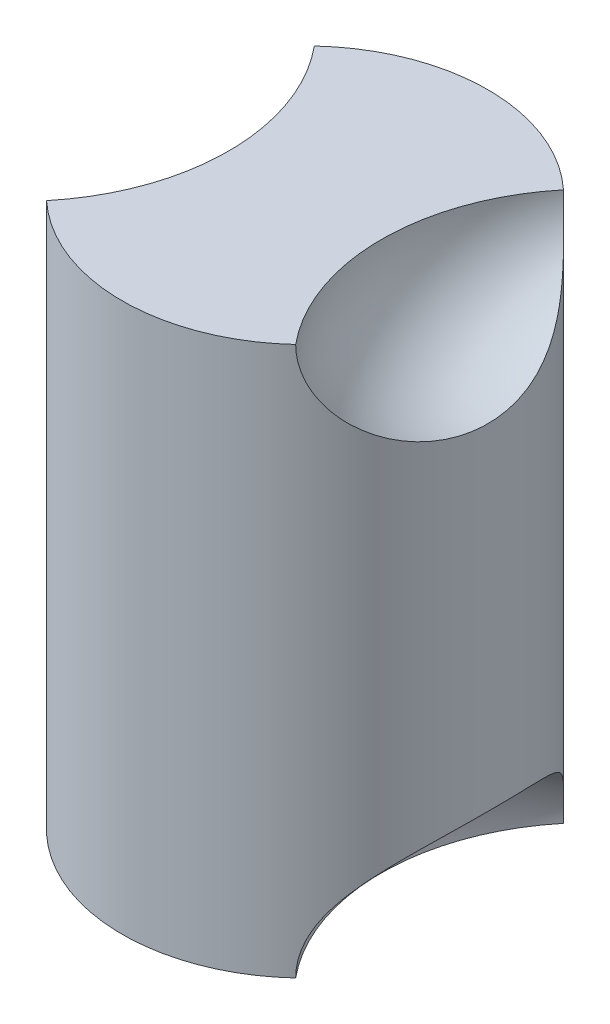
ISO-10303-21;
HEADER;
FILE_DESCRIPTION(('STEP AP214'),'2;1');
FILE_NAME('part.step','',(''),(''),'','','');
FILE_SCHEMA(('AUTOMOTIVE_DESIGN { 1 0 10303 214 1 1 1 1 }'));
ENDSEC;
DATA;
#1=APPLICATION_CONTEXT('core data for automotive mechanical design processes');
#2=APPLICATION_PROTOCOL_DEFINITION('international standard','automotive_design',2000,#1);
#3=PRODUCT_CONTEXT('',#1,'mechanical');
#4=PRODUCT('Part','Part','',(#3));
#5=PRODUCT_RELATED_PRODUCT_CATEGORY('part','',(#4));
#6=PRODUCT_DEFINITION_FORMATION('','',#4);
#7=PRODUCT_DEFINITION_CONTEXT('part definition',#1,'design');
#8=PRODUCT_DEFINITION('design','',#6,#7);
#9=PRODUCT_DEFINITION_SHAPE('','',#8);
#10=(LENGTH_UNIT() NAMED_UNIT(*) SI_UNIT(.MILLI.,.METRE.));
#11=(NAMED_UNIT(*) PLANE_ANGLE_UNIT() SI_UNIT($,.RADIAN.));
#12=(NAMED_UNIT(*) SI_UNIT($,.STERADIAN.) SOLID_ANGLE_UNIT());
#13=UNCERTAINTY_MEASURE_WITH_UNIT(LENGTH_MEASURE(1.E-05),#10,'distance_accuracy_value','');
#14=(GEOMETRIC_REPRESENTATION_CONTEXT(3) GLOBAL_UNCERTAINTY_ASSIGNED_CONTEXT((#13)) GLOBAL_UNIT_ASSIGNED_CONTEXT((#10,
#11,#12)) REPRESENTATION_CONTEXT('',''));
#15=CARTESIAN_POINT('',(0.,0.,0.));
#16=DIRECTION('',(0.,0.,1.));
#17=DIRECTION('',(1.,0.,0.));
#18=AXIS2_PLACEMENT_3D('',#15,#16,#17);
#19=CARTESIAN_POINT('',(0.,38.1,0.));
#20=DIRECTION('',(0.,-1.,0.));
#21=DIRECTION('',(0.,0.,-1.));
#22=AXIS2_PLACEMENT_3D('',#19,#20,#21);
#23=CYLINDRICAL_SURFACE('',#22,12.7);
#24=CARTESIAN_POINT('',(0.,38.1,0.));
#25=DIRECTION('',(0.,1.,0.));
#26=DIRECTION('',(0.,0.,1.));
#27=AXIS2_PLACEMENT_3D('',#24,#25,#26);
#28=CIRCLE('',#27,12.7);
#29=CARTESIAN_POINT('',(-8.64997313591612,38.1,9.29881523356226));
#30=VERTEX_POINT('',#29);
#31=CARTESIAN_POINT('',(8.64997313591612,38.1,9.29881523356226));
#32=VERTEX_POINT('',#31);
#33=EDGE_CURVE('E87',#30,#32,#28,.T.);
#34=ORIENTED_EDGE('',*,*,#33,.F.);
#35=CARTESIAN_POINT('',(-8.64997313870916,38.1002,9.29881523096411));
#36=CARTESIAN_POINT('',(-8.64992629520042,37.9503414706111,9.29883137637601));
#37=CARTESIAN_POINT('',(-8.65466748545901,37.8004988960325,9.29444776890676));
#38=CARTESIAN_POINT('',(-8.67340999581076,37.5019801272712,9.27697465001974));
#39=CARTESIAN_POINT('',(-8.68740650259926,37.353303367442,9.26388966380673));
#40=CARTESIAN_POINT('',(-8.72422864851798,37.05901712109,9.22921612968367));
#41=CARTESIAN_POINT('',(-8.74699844704149,36.91339425681,9.20768134777387));
#42=CARTESIAN_POINT('',(-8.80080287420278,36.6251741127673,9.15626890338947));
#43=CARTESIAN_POINT('',(-8.83183833435583,36.4825771389644,9.12639040153234));
#44=CARTESIAN_POINT('',(-8.90185405623256,36.1996197876203,9.05811273611667));
#45=CARTESIAN_POINT('',(-8.94092086845584,36.0593034491358,9.01962030580213));
#46=CARTESIAN_POINT('',(-9.02592498433122,35.7832258110867,8.93455609147142));
#47=CARTESIAN_POINT('',(-9.07186498435338,35.6474663248933,8.8879811355068));
#48=CARTESIAN_POINT('',(-9.16973539451844,35.3808949754204,8.78697333725758));
#49=CARTESIAN_POINT('',(-9.22167417291313,35.2500903701143,8.73252949066976));
#50=CARTESIAN_POINT('',(-9.33052268056618,34.9939980201523,8.61613016685607));
#51=CARTESIAN_POINT('',(-9.38743337654017,34.8687113555329,8.55417322790805));
#52=CARTESIAN_POINT('',(-9.52890681583383,34.5747902153565,8.39673567323764));
#53=CARTESIAN_POINT('',(-9.61540196821254,34.4089346172792,8.29777908346244));
#54=CARTESIAN_POINT('',(-9.79369987441479,34.0889436490906,8.08656605656412));
#55=CARTESIAN_POINT('',(-9.88550436796502,33.9348121593934,7.97430524722261));
#56=CARTESIAN_POINT('',(-10.0721435567159,33.6382129415999,7.73722839306141));
#57=CARTESIAN_POINT('',(-10.1669812620864,33.4957573335981,7.61239959418409));
#58=CARTESIAN_POINT('',(-10.357461297533,33.2225714533172,7.35113132659748));
#59=CARTESIAN_POINT('',(-10.4531035691654,33.0918403372774,7.21469269477682));
#60=CARTESIAN_POINT('',(-10.6447001111246,32.8400288741827,6.92895202634197));
#61=CARTESIAN_POINT('',(-10.7406387298148,32.7191163141403,6.77949191512985));
#62=CARTESIAN_POINT('',(-10.9296882127076,32.4887846126057,6.47029790223098));
#63=CARTESIAN_POINT('',(-11.0227990627108,32.3793655288201,6.31056394896764));
#64=CARTESIAN_POINT('',(-11.204667936123,32.1717178977877,5.98169828699375));
#65=CARTESIAN_POINT('',(-11.2934269913463,32.0734866905065,5.81256882645051));
#66=CARTESIAN_POINT('',(-11.4653154746748,31.8878646342895,5.46571301819944));
#67=CARTESIAN_POINT('',(-11.5484444466211,31.800474663253,5.28798597589608));
#68=CARTESIAN_POINT('',(-11.7224621818714,31.6212925295512,4.8917094993324));
#69=CARTESIAN_POINT('',(-11.8120087659485,31.5315949663129,4.67161837228924));
#70=CARTESIAN_POINT('',(-11.9800668964632,31.3665251151909,4.22203867518035));
#71=CARTESIAN_POINT('',(-12.0585773147714,31.291154291526,3.99254914749116));
#72=CARTESIAN_POINT('',(-12.2032962857259,31.154359288614,3.52552835981709));
#73=CARTESIAN_POINT('',(-12.2694984422644,31.0929423569823,3.28799299410661));
#74=CARTESIAN_POINT('',(-12.3885041055878,30.9838279281726,2.80650537329313));
#75=CARTESIAN_POINT('',(-12.4413075336076,30.9361305116452,2.56255308047726));
#76=CARTESIAN_POINT('',(-12.535235004511,30.8519820785257,2.05616025684534));
#77=CARTESIAN_POINT('',(-12.5755537623836,30.8162969056549,1.79344235766823));
#78=CARTESIAN_POINT('',(-12.6397099961049,30.7597940522981,1.26441205196955));
#79=CARTESIAN_POINT('',(-12.6635467548897,30.7389770186623,0.998099489572791));
#80=CARTESIAN_POINT('',(-12.6943508683748,30.7121136263482,0.463758276434472));
#81=CARTESIAN_POINT('',(-12.7013182337065,30.7060672583612,0.195729626774525));
#82=CARTESIAN_POINT('',(-12.6982711563677,30.7087169969457,-0.340155440319245));
#83=CARTESIAN_POINT('',(-12.6882568469605,30.7174129878268,-0.608011859088146));
#84=CARTESIAN_POINT('',(-12.6513057398422,30.7496771704669,-1.14315063444686));
#85=CARTESIAN_POINT('',(-12.6242755672856,30.7733274272209,-1.41042160419316));
#86=CARTESIAN_POINT('',(-12.553651924425,30.8356889320629,-1.94099111616351));
#87=CARTESIAN_POINT('',(-12.5100582788221,30.87440033955,-2.20428961631443));
#88=CARTESIAN_POINT('',(-12.4070298186442,30.9670810887003,-2.72508364448819));
#89=CARTESIAN_POINT('',(-12.3475924207302,31.0210529186771,-2.98257821874299));
#90=CARTESIAN_POINT('',(-12.2139065142845,31.1445220959948,-3.48988422343175));
#91=CARTESIAN_POINT('',(-12.1396581715298,31.2140192695636,-3.73969573982506));
#92=CARTESIAN_POINT('',(-11.9776793509475,31.3689042735009,-4.22987330918316));
#93=CARTESIAN_POINT('',(-11.8899476370356,31.4542935609261,-4.47023849361863));
#94=CARTESIAN_POINT('',(-11.7026722897888,31.6414135931605,-4.93977133570863));
#95=CARTESIAN_POINT('',(-11.6031280059046,31.7431452380955,-5.16893837566989));
#96=CARTESIAN_POINT('',(-11.3942946987862,31.963460797627,-5.61431479503953));
#97=CARTESIAN_POINT('',(-11.2850074997418,32.0820415599807,-5.8305265874675));
#98=CARTESIAN_POINT('',(-11.0591394452816,32.3366690012277,-6.24834328150827));
#99=CARTESIAN_POINT('',(-10.9425599892382,32.4727123343211,-6.44995096969814));
#100=CARTESIAN_POINT('',(-10.726104303417,32.737180698386,-6.80261818162539));
#101=CARTESIAN_POINT('',(-10.6269281223202,32.8626851344275,-6.95630499881878));
#102=CARTESIAN_POINT('',(-10.4275548978606,33.1262837545384,-7.25174711114298));
#103=CARTESIAN_POINT('',(-10.3273580267547,33.2643758445207,-7.39350438335871));
#104=CARTESIAN_POINT('',(-10.1282047253717,33.5533081486074,-7.66405028205845));
#105=CARTESIAN_POINT('',(-10.0292473422341,33.7041377793561,-7.79284948387232));
#106=CARTESIAN_POINT('',(-9.8349760712312,34.018754437027,-8.03663655278248));
#107=CARTESIAN_POINT('',(-9.73966138337339,34.1825385943973,-8.15162746441538));
#108=CARTESIAN_POINT('',(-9.57470675124315,34.487310521499,-8.34431294458977));
#109=CARTESIAN_POINT('',(-9.50386618270342,34.6259021773658,-8.42477804283082));
#110=CARTESIAN_POINT('',(-9.36766036261675,34.9108558626463,-8.57597152459315));
#111=CARTESIAN_POINT('',(-9.30229389901083,35.0572161601636,-8.64670206575278));
#112=CARTESIAN_POINT('',(-9.17866334338888,35.3570072528391,-8.77782717919034));
#113=CARTESIAN_POINT('',(-9.12038554924684,35.5104235911706,-8.83824178613165));
#114=CARTESIAN_POINT('',(-9.01231777551657,35.8238527987879,-8.94841248441229));
#115=CARTESIAN_POINT('',(-8.96252322194551,35.9838620551452,-8.99817432323492));
#116=CARTESIAN_POINT('',(-8.87505293579007,36.3014663159784,-9.0844384911118));
#117=CARTESIAN_POINT('',(-8.836895570806,36.4587816715097,-9.12147959727554));
#118=CARTESIAN_POINT('',(-8.77056562999613,36.7775290044583,-9.18527626329785));
#119=CARTESIAN_POINT('',(-8.7423912888625,36.9389602486415,-9.21203364170893));
#120=CARTESIAN_POINT('',(-8.69666492962379,37.266192403663,-9.25521624768204));
#121=CARTESIAN_POINT('',(-8.67920817408532,37.4320192117243,-9.2715488647082));
#122=CARTESIAN_POINT('',(-8.66169392096538,37.681915619323,-9.28790145057008));
#123=CARTESIAN_POINT('',(-8.65730095757579,37.7654519419944,-9.29199459524974));
#124=CARTESIAN_POINT('',(-8.65143817681674,37.9327211309636,-9.29745266870109));
#125=CARTESIAN_POINT('',(-8.64996853988071,38.0164540090739,-9.29881742907158));
#126=CARTESIAN_POINT('',(-8.64997313870917,38.1002,-9.29881523096413));
#127=B_SPLINE_CURVE_WITH_KNOTS('',3,(#35,#36,#37,#38,#39,#40,#41,#42,#43,#44,#45,#46,#47,#48,
#49,#50,#51,#52,#53,#54,#55,#56,#57,#58,#59,#60,#61,#62,#63,#64,#65,#66,#67,#68,#69,#70,#71,#72,
#73,#74,#75,#76,#77,#78,#79,#80,#81,#82,#83,#84,#85,#86,#87,#88,#89,#90,#91,#92,#93,#94,#95,#96,
#97,#98,#99,#100,#101,#102,#103,#104,#105,#106,#107,#108,#109,#110,#111,#112,#113,#114,#115,
#116,#117,#118,#119,#120,#121,#122,#123,#124,#125,#126),.UNSPECIFIED.,.F.,.F.,(4,2,2,2,2,2,2,2,
2,2,2,2,2,2,2,2,2,2,2,2,2,2,2,2,2,2,2,2,2,2,2,2,2,2,2,2,2,2,2,2,2,2,2,2,2,4),(0.,
0.449410767302183,0.898587998400594,1.34495229511355,1.79136151249139,2.24286060485194,
2.69453728823089,3.14685184584979,3.59925454589589,4.23319045643747,4.86733528059213,
5.50213025164389,6.1368795025386,6.78084983210216,7.42482339476958,8.06864352495179,
8.71251575628074,9.47359840529154,10.2347587965527,10.9963136333236,11.7578729468234,
12.5614567976193,13.3650756068423,14.1686939096107,14.9723059060291,15.7803666440512,
16.5884359343873,17.396637061871,18.2048291437719,19.0130953607027,19.8214061116483,
20.6295658371656,21.4375709510844,22.1024210640726,22.7671607734824,23.4313534986358,
24.0953995085528,24.6205682907761,25.1456204826433,25.669641072706,26.1933782216205,
26.6909154724039,27.188364699233,27.6901737734176,27.9413461270625,28.1925339830763),.UNSPECIFIED.);
#128=CARTESIAN_POINT('',(-8.64997313591612,38.1,-9.29881523356226));
#129=VERTEX_POINT('',#128);
#130=EDGE_CURVE('E54',#30,#129,#127,.T.);
#131=ORIENTED_EDGE('',*,*,#130,.T.);
#132=CARTESIAN_POINT('',(8.64997313591612,38.1,-9.29881523356226));
#133=VERTEX_POINT('',#132);
#134=EDGE_CURVE('E93',#133,#129,#28,.T.);
#135=ORIENTED_EDGE('',*,*,#134,.F.);
#136=CARTESIAN_POINT('',(8.64997313870916,38.1002,-9.29881523096411));
#137=CARTESIAN_POINT('',(8.64992629520042,37.9503414706111,-9.29883137637601));
#138=CARTESIAN_POINT('',(8.65466748545901,37.8004988960325,-9.29444776890676));
#139=CARTESIAN_POINT('',(8.67340999581076,37.5019801272712,-9.27697465001974));
#140=CARTESIAN_POINT('',(8.68740650259926,37.353303367442,-9.26388966380673));
#141=CARTESIAN_POINT('',(8.72422864851798,37.05901712109,-9.22921612968367));
#142=CARTESIAN_POINT('',(8.74699844704149,36.91339425681,-9.20768134777387));
#143=CARTESIAN_POINT('',(8.80080287420278,36.6251741127673,-9.15626890338947));
#144=CARTESIAN_POINT('',(8.83183833435583,36.4825771389644,-9.12639040153234));
#145=CARTESIAN_POINT('',(8.90185405623256,36.1996197876203,-9.05811273611667));
#146=CARTESIAN_POINT('',(8.94092086845584,36.0593034491358,-9.01962030580213));
#147=CARTESIAN_POINT('',(9.02592498433122,35.7832258110867,-8.93455609147142));
#148=CARTESIAN_POINT('',(9.07186498435337,35.6474663248933,-8.8879811355068));
#149=CARTESIAN_POINT('',(9.16973539451844,35.3808949754204,-8.78697333725758));
#150=CARTESIAN_POINT('',(9.22167417291314,35.2500903701143,-8.73252949066976));
#151=CARTESIAN_POINT('',(9.33052268056618,34.9939980201523,-8.61613016685607));
#152=CARTESIAN_POINT('',(9.38743337654017,34.8687113555329,-8.55417322790804));
#153=CARTESIAN_POINT('',(9.52890681583383,34.5747902153565,-8.39673567323764));
#154=CARTESIAN_POINT('',(9.61540196821254,34.4089346172792,-8.29777908346244));
#155=CARTESIAN_POINT('',(9.79369987441479,34.0889436490906,-8.08656605656412));
#156=CARTESIAN_POINT('',(9.88550436796502,33.9348121593934,-7.97430524722261));
#157=CARTESIAN_POINT('',(10.0721435567159,33.6382129415999,-7.73722839306142));
#158=CARTESIAN_POINT('',(10.1669812620864,33.4957573335981,-7.6123995941841));
#159=CARTESIAN_POINT('',(10.357461297533,33.2225714533172,-7.35113132659748));
#160=CARTESIAN_POINT('',(10.4531035691653,33.0918403372774,-7.21469269477683));
#161=CARTESIAN_POINT('',(10.6447001111246,32.8400288741827,-6.92895202634198));
#162=CARTESIAN_POINT('',(10.7406387298148,32.7191163141403,-6.77949191512986));
#163=CARTESIAN_POINT('',(10.9296882127076,32.4887846126057,-6.47029790223099));
#164=CARTESIAN_POINT('',(11.0227990627108,32.3793655288201,-6.31056394896765));
#165=CARTESIAN_POINT('',(11.204667936123,32.1717178977877,-5.98169828699375));
#166=CARTESIAN_POINT('',(11.2934269913463,32.0734866905065,-5.81256882645052));
#167=CARTESIAN_POINT('',(11.4653154746748,31.8878646342895,-5.46571301819945));
#168=CARTESIAN_POINT('',(11.5484444466211,31.8004746632531,-5.28798597589608));
#169=CARTESIAN_POINT('',(11.7224621818714,31.6212925295512,-4.8917094993324));
#170=CARTESIAN_POINT('',(11.8120087659485,31.5315949663129,-4.67161837228924));
#171=CARTESIAN_POINT('',(11.9800668964632,31.3665251151909,-4.22203867518035));
#172=CARTESIAN_POINT('',(12.0585773147714,31.291154291526,-3.99254914749117));
#173=CARTESIAN_POINT('',(12.2032962857259,31.154359288614,-3.5255283598171));
#174=CARTESIAN_POINT('',(12.2694984422644,31.0929423569823,-3.28799299410661));
#175=CARTESIAN_POINT('',(12.3885041055878,30.9838279281726,-2.80650537329314));
#176=CARTESIAN_POINT('',(12.4413075336076,30.9361305116452,-2.56255308047727));
#177=CARTESIAN_POINT('',(12.535235004511,30.8519820785257,-2.05616025684534));
#178=CARTESIAN_POINT('',(12.5755537623836,30.8162969056549,-1.79344235766824));
#179=CARTESIAN_POINT('',(12.6397099961049,30.7597940522981,-1.26441205196956));
#180=CARTESIAN_POINT('',(12.6635467548897,30.7389770186623,-0.998099489572798));
#181=CARTESIAN_POINT('',(12.6943508683748,30.7121136263482,-0.46375827643448));
#182=CARTESIAN_POINT('',(12.7013182337065,30.7060672583612,-0.195729626774533));
#183=CARTESIAN_POINT('',(12.6982711563677,30.7087169969457,0.340155440319238));
#184=CARTESIAN_POINT('',(12.6882568469605,30.7174129878268,0.608011859088138));
#185=CARTESIAN_POINT('',(12.6513057398422,30.7496771704669,1.14315063444685));
#186=CARTESIAN_POINT('',(12.6242755672856,30.7733274272209,1.41042160419315));
#187=CARTESIAN_POINT('',(12.553651924425,30.8356889320629,1.9409911161635));
#188=CARTESIAN_POINT('',(12.5100582788221,30.87440033955,2.20428961631442));
#189=CARTESIAN_POINT('',(12.4070298186442,30.9670810887003,2.72508364448819));
#190=CARTESIAN_POINT('',(12.3475924207302,31.0210529186771,2.98257821874298));
#191=CARTESIAN_POINT('',(12.2139065142845,31.1445220959948,3.48988422343174));
#192=CARTESIAN_POINT('',(12.1396581715298,31.2140192695636,3.73969573982506));
#193=CARTESIAN_POINT('',(11.9776793509475,31.3689042735009,4.22987330918316));
#194=CARTESIAN_POINT('',(11.8899476370356,31.4542935609261,4.47023849361862));
#195=CARTESIAN_POINT('',(11.7026722897888,31.6414135931605,4.93977133570863));
#196=CARTESIAN_POINT('',(11.6031280059046,31.7431452380955,5.16893837566988));
#197=CARTESIAN_POINT('',(11.3942946987862,31.963460797627,5.61431479503953));
#198=CARTESIAN_POINT('',(11.2850074997418,32.0820415599807,5.8305265874675));
#199=CARTESIAN_POINT('',(11.0591394452816,32.3366690012277,6.24834328150827));
#200=CARTESIAN_POINT('',(10.9425599892382,32.4727123343211,6.44995096969814));
#201=CARTESIAN_POINT('',(10.726104303417,32.737180698386,6.80261818162538));
#202=CARTESIAN_POINT('',(10.6269281223202,32.8626851344275,6.95630499881877));
#203=CARTESIAN_POINT('',(10.4275548978606,33.1262837545384,7.25174711114297));
#204=CARTESIAN_POINT('',(10.3273580267547,33.2643758445206,7.3935043833587));
#205=CARTESIAN_POINT('',(10.1282047253717,33.5533081486074,7.66405028205844));
#206=CARTESIAN_POINT('',(10.0292473422341,33.7041377793561,7.79284948387232));
#207=CARTESIAN_POINT('',(9.8349760712312,34.018754437027,8.03663655278248));
#208=CARTESIAN_POINT('',(9.7396613833734,34.1825385943973,8.15162746441537));
#209=CARTESIAN_POINT('',(9.57470675124315,34.487310521499,8.34431294458977));
#210=CARTESIAN_POINT('',(9.50386618270342,34.6259021773658,8.42477804283082));
#211=CARTESIAN_POINT('',(9.36766036261675,34.9108558626463,8.57597152459316));
#212=CARTESIAN_POINT('',(9.30229389901082,35.0572161601636,8.64670206575278));
#213=CARTESIAN_POINT('',(9.17866334338888,35.3570072528391,8.77782717919034));
#214=CARTESIAN_POINT('',(9.12038554924684,35.5104235911706,8.83824178613165));
#215=CARTESIAN_POINT('',(9.01231777551658,35.8238527987879,8.94841248441229));
#216=CARTESIAN_POINT('',(8.96252322194551,35.9838620551452,8.99817432323492));
#217=CARTESIAN_POINT('',(8.87505293579007,36.3014663159784,9.0844384911118));
#218=CARTESIAN_POINT('',(8.83689557080601,36.4587816715097,9.12147959727554));
#219=CARTESIAN_POINT('',(8.77056562999613,36.7775290044583,9.18527626329785));
#220=CARTESIAN_POINT('',(8.74239128886251,36.9389602486415,9.21203364170893));
#221=CARTESIAN_POINT('',(8.69666492962379,37.266192403663,9.25521624768204));
#222=CARTESIAN_POINT('',(8.67920817408532,37.4320192117243,9.27154886470821));
#223=CARTESIAN_POINT('',(8.66169392096538,37.681915619323,9.28790145057008));
#224=CARTESIAN_POINT('',(8.65730095757579,37.7654519419944,9.29199459524973));
#225=CARTESIAN_POINT('',(8.65143817681674,37.9327211309636,9.29745266870109));
#226=CARTESIAN_POINT('',(8.64996853988071,38.0164540090739,9.29881742907158));
#227=CARTESIAN_POINT('',(8.64997313870917,38.1002,9.29881523096413));
#228=B_SPLINE_CURVE_WITH_KNOTS('',3,(#136,#137,#138,#139,#140,#141,#142,#143,#144,#145,#146,
#147,#148,#149,#150,#151,#152,#153,#154,#155,#156,#157,#158,#159,#160,#161,#162,#163,#164,#165,
#166,#167,#168,#169,#170,#171,#172,#173,#174,#175,#176,#177,#178,#179,#180,#181,#182,#183,#184,
#185,#186,#187,#188,#189,#190,#191,#192,#193,#194,#195,#196,#197,#198,#199,#200,#201,#202,#203,
#204,#205,#206,#207,#208,#209,#210,#211,#212,#213,#214,#215,#216,#217,#218,#219,#220,#221,#222,
#223,#224,#225,#226,#227),.UNSPECIFIED.,.F.,.F.,(4,2,2,2,2,2,2,2,2,2,2,2,2,2,2,2,2,2,2,2,2,2,2,
2,2,2,2,2,2,2,2,2,2,2,2,2,2,2,2,2,2,2,2,2,2,4),(0.,0.449410767302183,0.898587998400594,
1.34495229511355,1.79136151249139,2.24286060485194,2.69453728823089,3.1468518458498,
3.59925454589589,4.23319045643746,4.86733528059212,5.50213025164388,6.13687950253859,
6.78084983210215,7.42482339476957,8.06864352495178,8.71251575628074,9.47359840529154,
10.2347587965527,10.9963136333236,11.7578729468234,12.5614567976193,13.3650756068423,
14.1686939096107,14.9723059060291,15.7803666440512,16.5884359343873,17.396637061871,
18.2048291437719,19.0130953607027,19.8214061116483,20.6295658371656,21.4375709510844,
22.1024210640726,22.7671607734824,23.4313534986358,24.0953995085528,24.6205682907761,
25.1456204826433,25.669641072706,26.1933782216205,26.6909154724039,27.188364699233,
27.6901737734176,27.9413461270625,28.1925339830764),.UNSPECIFIED.);
#229=EDGE_CURVE('E85',#133,#32,#228,.T.);
#230=ORIENTED_EDGE('',*,*,#229,.T.);
#231=EDGE_LOOP('',(#34,#131,#135,#230));
#232=FACE_BOUND('',#231,.T.);
#233=CARTESIAN_POINT('',(0.,0.,0.));
#234=DIRECTION('',(0.,1.,0.));
#235=DIRECTION('',(0.,0.,1.));
#236=AXIS2_PLACEMENT_3D('',#233,#234,#235);
#237=CIRCLE('',#236,12.7);
#238=CARTESIAN_POINT('',(8.64997313591612,0.,-9.29881523356226));
#239=VERTEX_POINT('',#238);
#240=CARTESIAN_POINT('',(-8.67555789829929,0.,-9.27494987335549));
#241=VERTEX_POINT('',#240);
#242=EDGE_CURVE('E80',#239,#241,#237,.T.);
#243=ORIENTED_EDGE('',*,*,#242,.T.);
#244=CARTESIAN_POINT('',(-8.67555790110473,-0.0002,-9.27494987073134));
#245=CARTESIAN_POINT('',(-8.67551137119982,0.148631823683691,-9.27496626739664));
#246=CARTESIAN_POINT('',(-8.68020865294425,0.297447704692947,-9.2705990096083));
#247=CARTESIAN_POINT('',(-8.69877709586851,0.593920422688027,-9.25319256238787));
#248=CARTESIAN_POINT('',(-8.71264346036504,0.741577824870689,-9.24015790716911));
#249=CARTESIAN_POINT('',(-8.74912184403092,1.03384219330492,-9.20562082332705));
#250=CARTESIAN_POINT('',(-8.77167830738624,1.17846250446986,-9.18417216983458));
#251=CARTESIAN_POINT('',(-8.82497683443859,1.46469901598492,-9.13297083491555));
#252=CARTESIAN_POINT('',(-8.85571972786657,1.60631491025237,-9.10321731173892));
#253=CARTESIAN_POINT('',(-8.92507482299277,1.88733449114095,-9.03523205161407));
#254=CARTESIAN_POINT('',(-8.96377312104043,2.02669426409158,-8.99690711459106));
#255=CARTESIAN_POINT('',(-9.04797293214195,2.30089328623777,-8.91222474928957));
#256=CARTESIAN_POINT('',(-9.09347711309657,2.43573073719711,-8.86586416990822));
#257=CARTESIAN_POINT('',(-9.19041703750567,2.7004986632116,-8.76533586543757));
#258=CARTESIAN_POINT('',(-9.24186111686509,2.83042189406128,-8.71115714127926));
#259=CARTESIAN_POINT('',(-9.34967108224285,3.08479736834997,-8.59534251903349));
#260=CARTESIAN_POINT('',(-9.40603793018496,3.20924853535631,-8.53370516259553));
#261=CARTESIAN_POINT('',(-9.54637182058451,3.50166794160716,-8.37686573261515));
#262=CARTESIAN_POINT('',(-9.63227283080998,3.66685212874409,-8.2781786920791));
#263=CARTESIAN_POINT('',(-9.80935591588426,3.98554666286814,-8.06755688882226));
#264=CARTESIAN_POINT('',(-9.90053973886492,4.13905310626347,-7.95561772791823));
#265=CARTESIAN_POINT('',(-10.0859228180046,4.4344559751788,-7.71924477477887));
#266=CARTESIAN_POINT('',(-10.1801250992778,4.5763402122136,-7.59479816261982));
#267=CARTESIAN_POINT('',(-10.369331985409,4.84844185679547,-7.33436167726826));
#268=CARTESIAN_POINT('',(-10.4643365313418,4.97866011317387,-7.1983726453211));
#269=CARTESIAN_POINT('',(-10.6546904092323,5.22954307031427,-6.91356228350374));
#270=CARTESIAN_POINT('',(-10.7500239017298,5.35003713653917,-6.76458035108566));
#271=CARTESIAN_POINT('',(-10.9378861863962,5.57959410520533,-6.45640887095872));
#272=CARTESIAN_POINT('',(-11.0304149639332,5.68865694801872,-6.29721927001133));
#273=CARTESIAN_POINT('',(-11.2111544681402,5.89565743194177,-5.96950764719116));
#274=CARTESIAN_POINT('',(-11.2993662388668,5.99359777064178,-5.80098790301199));
#275=CARTESIAN_POINT('',(-11.4702066394251,6.17870668462297,-5.45541254039012));
#276=CARTESIAN_POINT('',(-11.5528348113259,6.2658743768856,-5.27835622386808));
#277=CARTESIAN_POINT('',(-11.7260491249552,6.44488361834812,-4.88308501055843));
#278=CARTESIAN_POINT('',(-11.8152816225425,6.53460905423714,-4.66331328909169));
#279=CARTESIAN_POINT('',(-11.9827491914995,6.69976778647783,-4.21439640304906));
#280=CARTESIAN_POINT('',(-12.0609831245347,6.77519960374236,-3.98525027139989));
#281=CARTESIAN_POINT('',(-12.2051909829556,6.91215432653649,-3.51893484077408));
#282=CARTESIAN_POINT('',(-12.2711584235128,6.97366987876623,-3.28176137591942));
#283=CARTESIAN_POINT('',(-12.3897389486296,7.08302108697293,-2.80101272812169));
#284=CARTESIAN_POINT('',(-12.4423519494465,7.13085665716605,-2.55743750504521));
#285=CARTESIAN_POINT('',(-12.5360002678688,7.21538943953665,-2.05147991625383));
#286=CARTESIAN_POINT('',(-12.5762117594846,7.25130299521024,-1.7888133642163));
#287=CARTESIAN_POINT('',(-12.6401612739088,7.30826906534002,-1.25987996924041));
#288=CARTESIAN_POINT('',(-12.6638985638167,7.32932091863292,-0.993612966663198));
#289=CARTESIAN_POINT('',(-12.6945099361857,7.35665981240199,-0.459355837890315));
#290=CARTESIAN_POINT('',(-12.7013840113217,7.36294684646469,-0.191365710946216));
#291=CARTESIAN_POINT('',(-12.6981546700869,7.36078219084805,0.344449908755746));
#292=CARTESIAN_POINT('',(-12.6880513897107,7.35233061923017,0.612275402815186));
#293=CARTESIAN_POINT('',(-12.6509203966885,7.32055364229416,1.14741523508829));
#294=CARTESIAN_POINT('',(-12.6237958415134,7.29714311398835,1.41471780883714));
#295=CARTESIAN_POINT('',(-12.5529772121713,7.23525018243135,1.94535638725704));
#296=CARTESIAN_POINT('',(-12.5092829560495,7.19676761367122,2.20869234833699));
#297=CARTESIAN_POINT('',(-12.4060458443705,7.10452699420976,2.72956551939795));
#298=CARTESIAN_POINT('',(-12.3465003357173,7.0507663862519,2.98710175081835));
#299=CARTESIAN_POINT('',(-12.2125910492824,6.92769416400014,3.49448990118617));
#300=CARTESIAN_POINT('',(-12.1382274490208,6.85838273600311,3.74434191214882));
#301=CARTESIAN_POINT('',(-11.9760611651243,6.70388029707448,4.23444776133075));
#302=CARTESIAN_POINT('',(-11.8882652674748,6.61869729973893,4.47470636927316));
#303=CARTESIAN_POINT('',(-11.7008735590733,6.43196358006901,4.94402652966014));
#304=CARTESIAN_POINT('',(-11.6012770881369,6.33041194187455,5.17308745463547));
#305=CARTESIAN_POINT('',(-11.3923573261312,6.11042088065211,5.61824130623447));
#306=CARTESIAN_POINT('',(-11.2830360203043,5.99198490145783,5.83433686461403));
#307=CARTESIAN_POINT('',(-11.0571241243993,5.73759871123237,6.25190509564999));
#308=CARTESIAN_POINT('',(-10.9405349636404,5.60165193835677,6.45338062676628));
#309=CARTESIAN_POINT('',(-10.7244954494849,5.3377936475015,6.80513052500459));
#310=CARTESIAN_POINT('',(-10.6257509451458,5.21286242589128,6.95808180242109));
#311=CARTESIAN_POINT('',(-10.4272764934276,4.95046897757952,7.25212705168442));
#312=CARTESIAN_POINT('',(-10.327546714705,4.8130088635023,7.39322301489379));
#313=CARTESIAN_POINT('',(-10.1293482126089,4.52539913087247,7.66252173390824));
#314=CARTESIAN_POINT('',(-10.030878509604,4.37526015887222,7.79073511304931));
#315=CARTESIAN_POINT('',(-9.83758584675591,4.06208239489343,8.03342755436322));
#316=CARTESIAN_POINT('',(-9.74276208705186,3.89904645657394,8.14790964077509));
#317=CARTESIAN_POINT('',(-9.57867707445092,3.59567332518644,8.33974778259634));
#318=CARTESIAN_POINT('',(-9.50821783407533,3.45772199362659,8.41986051865777));
#319=CARTESIAN_POINT('',(-9.37275445927101,3.17408514157361,8.57039802154229));
#320=CARTESIAN_POINT('',(-9.30774911665948,3.0284013457629,8.64082493625284));
#321=CARTESIAN_POINT('',(-9.18480876416112,2.72999590099358,8.77139212613167));
#322=CARTESIAN_POINT('',(-9.12686016393969,2.57728858602311,8.83155226642734));
#323=CARTESIAN_POINT('',(-9.01940899456397,2.26530970921948,8.94126168159025));
#324=CARTESIAN_POINT('',(-8.96990187551405,2.10604174137438,8.9908166762501));
#325=CARTESIAN_POINT('',(-8.88294553746205,1.78992718088738,9.07671908740293));
#326=CARTESIAN_POINT('',(-8.84501631796368,1.6333593527072,9.11360400940679));
#327=CARTESIAN_POINT('',(-8.77908507475552,1.31612925712643,9.17713272191497));
#328=CARTESIAN_POINT('',(-8.75108130016215,1.15546771723627,9.20377831874239));
#329=CARTESIAN_POINT('',(-8.70563319205338,0.829800790617568,9.2467804641887));
#330=CARTESIAN_POINT('',(-8.68828336881412,0.664769699883273,9.26304497168591));
#331=CARTESIAN_POINT('',(-8.6708765602812,0.416073500887753,9.27932939592066));
#332=CARTESIAN_POINT('',(-8.6665105863994,0.332938668913259,9.28340548715749));
#333=CARTESIAN_POINT('',(-8.66068385024418,0.166473578514564,9.28884082168687));
#334=CARTESIAN_POINT('',(-8.65922326682309,0.0831433083755371,9.29019989772325));
#335=CARTESIAN_POINT('',(-8.65922784165823,-0.00019999999999594,9.29019769360435));
#336=B_SPLINE_CURVE_WITH_KNOTS('',3,(#244,#245,#246,#247,#248,#249,#250,#251,#252,#253,#254,
#255,#256,#257,#258,#259,#260,#261,#262,#263,#264,#265,#266,#267,#268,#269,#270,#271,#272,#273,
#274,#275,#276,#277,#278,#279,#280,#281,#282,#283,#284,#285,#286,#287,#288,#289,#290,#291,#292,
#293,#294,#295,#296,#297,#298,#299,#300,#301,#302,#303,#304,#305,#306,#307,#308,#309,#310,#311,
#312,#313,#314,#315,#316,#317,#318,#319,#320,#321,#322,#323,#324,#325,#326,#327,#328,#329,#330,
#331,#332,#333,#334,#335),.UNSPECIFIED.,.F.,.F.,(4,2,2,2,2,2,2,2,2,2,2,2,2,2,2,2,2,2,2,2,2,2,2,
2,2,2,2,2,2,2,2,2,2,2,2,2,2,2,2,2,2,2,2,2,2,4),(0.,0.4463315790873,0.892429850294053,
1.33572231161102,1.77905971969456,2.22747477904175,2.67606607968745,3.12529475423751,
3.57461140666765,4.20586493408414,4.8373285556746,5.46944614852147,6.10151771028312,
6.74297780375845,7.38444124306944,8.02574877163386,8.66710883245067,9.4270614768728,
10.1870927174236,10.947524622325,11.7079612956053,12.5114378265018,13.3149500999871,
14.1184627224979,14.9219689086171,15.7300886145185,16.5382171947842,17.34648112033,
18.154735363492,18.9625826174626,19.7704750878967,20.5782030107643,21.3857725814114,
22.0475467256272,22.7092094870696,23.3703220661671,24.0312887705684,24.5539924247993,
25.0765799788951,25.5981446256521,26.1194272581566,26.6145816518234,27.1096486549795,
27.6090462007977,27.8590109046093,28.108990995471),.UNSPECIFIED.);
#337=CARTESIAN_POINT('',(-8.65922783885547,0.,9.29019769621673));
#338=VERTEX_POINT('',#337);
#339=EDGE_CURVE('E48',#241,#338,#336,.T.);
#340=ORIENTED_EDGE('',*,*,#339,.T.);
#341=CARTESIAN_POINT('',(8.64997313591612,0.,9.29881523356226));
#342=VERTEX_POINT('',#341);
#343=EDGE_CURVE('E78',#338,#342,#237,.T.);
#344=ORIENTED_EDGE('',*,*,#343,.T.);
#345=CARTESIAN_POINT('',(8.64997313870916,-0.0002,-9.29881523096411));
#346=CARTESIAN_POINT('',(8.64992629520042,0.149658529388905,-9.29883137637601));
#347=CARTESIAN_POINT('',(8.65466748545901,0.299501103967473,-9.29444776890676));
#348=CARTESIAN_POINT('',(8.67340999581076,0.598019872728817,-9.27697465001974));
#349=CARTESIAN_POINT('',(8.68740650259926,0.746696632558029,-9.26388966380673));
#350=CARTESIAN_POINT('',(8.72422864851798,1.04098287891005,-9.22921612968367));
#351=CARTESIAN_POINT('',(8.74699844704149,1.18660574319001,-9.20768134777387));
#352=CARTESIAN_POINT('',(8.80080287420278,1.47482588723274,-9.15626890338947));
#353=CARTESIAN_POINT('',(8.83183833435583,1.61742286103559,-9.12639040153234));
#354=CARTESIAN_POINT('',(8.90185405623257,1.90038021237975,-9.05811273611667));
#355=CARTESIAN_POINT('',(8.94092086845584,2.04069655086416,-9.01962030580213));
#356=CARTESIAN_POINT('',(9.02592498433122,2.31677418891332,-8.93455609147141));
#357=CARTESIAN_POINT('',(9.07186498435338,2.45253367510673,-8.8879811355068));
#358=CARTESIAN_POINT('',(9.16973539451845,2.71910502457956,-8.78697333725758));
#359=CARTESIAN_POINT('',(9.22167417291314,2.84990962988567,-8.73252949066976));
#360=CARTESIAN_POINT('',(9.33052268056618,3.10600197984769,-8.61613016685607));
#361=CARTESIAN_POINT('',(9.38743337654017,3.23128864446712,-8.55417322790804));
#362=CARTESIAN_POINT('',(9.52890681583383,3.5252097846435,-8.39673567323764));
#363=CARTESIAN_POINT('',(9.61540196821254,3.69106538272076,-8.29777908346244));
#364=CARTESIAN_POINT('',(9.79369987441479,4.01105635090942,-8.08656605656412));
#365=CARTESIAN_POINT('',(9.88550436796502,4.1651878406066,-7.97430524722261));
#366=CARTESIAN_POINT('',(10.0721435567159,4.4617870584001,-7.73722839306141));
#367=CARTESIAN_POINT('',(10.1669812620864,4.60424266640193,-7.6123995941841));
#368=CARTESIAN_POINT('',(10.357461297533,4.87742854668278,-7.35113132659748));
#369=CARTESIAN_POINT('',(10.4531035691654,5.00815966272257,-7.21469269477682));
#370=CARTESIAN_POINT('',(10.6447001111246,5.25997112581733,-6.92895202634197));
#371=CARTESIAN_POINT('',(10.7406387298148,5.38088368585968,-6.77949191512985));
#372=CARTESIAN_POINT('',(10.9296882127076,5.61121538739428,-6.47029790223099));
#373=CARTESIAN_POINT('',(11.0227990627108,5.72063447117987,-6.31056394896764));
#374=CARTESIAN_POINT('',(11.204667936123,5.92828210221229,-5.98169828699375));
#375=CARTESIAN_POINT('',(11.2934269913463,6.02651330949353,-5.81256882645052));
#376=CARTESIAN_POINT('',(11.4653154746748,6.21213536571053,-5.46571301819945));
#377=CARTESIAN_POINT('',(11.5484444466211,6.29952533674695,-5.28798597589608));
#378=CARTESIAN_POINT('',(11.7224621818714,6.4787074704488,-4.8917094993324));
#379=CARTESIAN_POINT('',(11.8120087659485,6.56840503368709,-4.67161837228924));
#380=CARTESIAN_POINT('',(11.9800668964632,6.73347488480906,-4.22203867518035));
#381=CARTESIAN_POINT('',(12.0585773147714,6.80884570847405,-3.99254914749117));
#382=CARTESIAN_POINT('',(12.2032962857259,6.945640711386,-3.5255283598171));
#383=CARTESIAN_POINT('',(12.2694984422644,7.0070576430177,-3.28799299410661));
#384=CARTESIAN_POINT('',(12.3885041055878,7.11617207182736,-2.80650537329313));
#385=CARTESIAN_POINT('',(12.4413075336076,7.16386948835478,-2.56255308047727));
#386=CARTESIAN_POINT('',(12.535235004511,7.2480179214743,-2.05616025684534));
#387=CARTESIAN_POINT('',(12.5755537623836,7.2837030943451,-1.79344235766823));
#388=CARTESIAN_POINT('',(12.6397099961049,7.34020594770194,-1.26441205196955));
#389=CARTESIAN_POINT('',(12.6635467548897,7.36102298133773,-0.998099489572794));
#390=CARTESIAN_POINT('',(12.6943508683748,7.38788637365181,-0.463758276434476));
#391=CARTESIAN_POINT('',(12.7013182337065,7.39393274163883,-0.195729626774529));
#392=CARTESIAN_POINT('',(12.6982711563677,7.39128300305432,0.340155440319241));
#393=CARTESIAN_POINT('',(12.6882568469605,7.38258701217317,0.608011859088142));
#394=CARTESIAN_POINT('',(12.6513057398422,7.35032282953309,1.14315063444686));
#395=CARTESIAN_POINT('',(12.6242755672856,7.32667257277912,1.41042160419316));
#396=CARTESIAN_POINT('',(12.553651924425,7.26431106793712,1.9409911161635));
#397=CARTESIAN_POINT('',(12.5100582788221,7.22559966044997,2.20428961631443));
#398=CARTESIAN_POINT('',(12.4070298186442,7.1329189112997,2.72508364448819));
#399=CARTESIAN_POINT('',(12.3475924207302,7.07894708132291,2.98257821874298));
#400=CARTESIAN_POINT('',(12.2139065142845,6.95547790400519,3.48988422343174));
#401=CARTESIAN_POINT('',(12.1396581715298,6.88598073043637,3.73969573982506));
#402=CARTESIAN_POINT('',(11.9776793509475,6.7310957264991,4.22987330918316));
#403=CARTESIAN_POINT('',(11.8899476370356,6.64570643907392,4.47023849361862));
#404=CARTESIAN_POINT('',(11.7026722897888,6.45858640683947,4.93977133570862));
#405=CARTESIAN_POINT('',(11.6031280059046,6.35685476190451,5.16893837566988));
#406=CARTESIAN_POINT('',(11.3942946987862,6.13653920237296,5.61431479503953));
#407=CARTESIAN_POINT('',(11.2850074997418,6.01795844001933,5.8305265874675));
#408=CARTESIAN_POINT('',(11.0591394452816,5.76333099877231,6.24834328150827));
#409=CARTESIAN_POINT('',(10.9425599892382,5.6272876656789,6.44995096969814));
#410=CARTESIAN_POINT('',(10.726104303417,5.36281930161397,6.80261818162539));
#411=CARTESIAN_POINT('',(10.6269281223202,5.23731486557254,6.95630499881877));
#412=CARTESIAN_POINT('',(10.4275548978606,4.97371624546161,7.25174711114297));
#413=CARTESIAN_POINT('',(10.3273580267547,4.83562415547937,7.3935043833587));
#414=CARTESIAN_POINT('',(10.1282047253717,4.54669185139262,7.66405028205844));
#415=CARTESIAN_POINT('',(10.0292473422341,4.39586222064393,7.79284948387232));
#416=CARTESIAN_POINT('',(9.8349760712312,4.08124556297298,8.03663655278248));
#417=CARTESIAN_POINT('',(9.7396613833734,3.91746140560275,8.15162746441538));
#418=CARTESIAN_POINT('',(9.57470675124315,3.61268947850105,8.34431294458977));
#419=CARTESIAN_POINT('',(9.50386618270342,3.47409782263423,8.42477804283082));
#420=CARTESIAN_POINT('',(9.36766036261675,3.18914413735373,8.57597152459315));
#421=CARTESIAN_POINT('',(9.30229389901082,3.04278383983637,8.64670206575278));
#422=CARTESIAN_POINT('',(9.17866334338888,2.74299274716086,8.77782717919034));
#423=CARTESIAN_POINT('',(9.12038554924684,2.58957640882944,8.83824178613166));
#424=CARTESIAN_POINT('',(9.01231777551658,2.27614720121215,8.94841248441229));
#425=CARTESIAN_POINT('',(8.96252322194551,2.11613794485481,8.99817432323492));
#426=CARTESIAN_POINT('',(8.87505293579007,1.79853368402156,9.0844384911118));
#427=CARTESIAN_POINT('',(8.836895570806,1.64121832849026,9.12147959727554));
#428=CARTESIAN_POINT('',(8.77056562999613,1.32247099554172,9.18527626329785));
#429=CARTESIAN_POINT('',(8.7423912888625,1.16103975135848,9.21203364170893));
#430=CARTESIAN_POINT('',(8.69666492962379,0.833807596336976,9.25521624768205));
#431=CARTESIAN_POINT('',(8.67920817408532,0.66798078827567,9.27154886470821));
#432=CARTESIAN_POINT('',(8.66169392096538,0.418084380677004,9.28790145057008));
#433=CARTESIAN_POINT('',(8.65730095757579,0.334548058005639,9.29199459524974));
#434=CARTESIAN_POINT('',(8.65143817681674,0.167278869036396,9.29745266870109));
#435=CARTESIAN_POINT('',(8.64996853988071,0.083545990926057,9.29881742907158));
#436=CARTESIAN_POINT('',(8.64997313870917,-0.00019999999999654,9.29881523096413));
#437=B_SPLINE_CURVE_WITH_KNOTS('',3,(#345,#346,#347,#348,#349,#350,#351,#352,#353,#354,#355,
#356,#357,#358,#359,#360,#361,#362,#363,#364,#365,#366,#367,#368,#369,#370,#371,#372,#373,#374,
#375,#376,#377,#378,#379,#380,#381,#382,#383,#384,#385,#386,#387,#388,#389,#390,#391,#392,#393,
#394,#395,#396,#397,#398,#399,#400,#401,#402,#403,#404,#405,#406,#407,#408,#409,#410,#411,#412,
#413,#414,#415,#416,#417,#418,#419,#420,#421,#422,#423,#424,#425,#426,#427,#428,#429,#430,#431,
#432,#433,#434,#435,#436),.UNSPECIFIED.,.F.,.F.,(4,2,2,2,2,2,2,2,2,2,2,2,2,2,2,2,2,2,2,2,2,2,2,
2,2,2,2,2,2,2,2,2,2,2,2,2,2,2,2,2,2,2,2,2,2,4),(0.,0.449410767302185,0.898587998400602,
1.34495229511356,1.7913615124914,2.24286060485195,2.69453728823089,3.1468518458498,
3.5992545458959,4.23319045643747,4.86733528059214,5.50213025164389,6.1368795025386,
6.78084983210216,7.42482339476958,8.06864352495179,8.71251575628074,9.47359840529154,
10.2347587965527,10.9963136333236,11.7578729468235,12.5614567976193,13.3650756068423,
14.1686939096108,14.9723059060291,15.7803666440513,16.5884359343873,17.396637061871,
18.2048291437719,19.0130953607027,19.8214061116483,20.6295658371656,21.4375709510844,
22.1024210640726,22.7671607734824,23.4313534986358,24.0953995085528,24.6205682907761,
25.1456204826433,25.669641072706,26.1933782216205,26.690915472404,27.188364699233,
27.6901737734177,27.9413461270625,28.1925339830764),.UNSPECIFIED.);
#438=EDGE_CURVE('E89',#239,#342,#437,.T.);
#439=ORIENTED_EDGE('',*,*,#438,.F.);
#440=EDGE_LOOP('',(#243,#340,#344,#439));
#441=FACE_BOUND('',#440,.T.);
#442=ADVANCED_FACE('F34',(#232,#441),#23,.T.);
#443=CARTESIAN_POINT('',(0.,38.1,0.));
#444=DIRECTION('',(0.,1.,0.));
#445=DIRECTION('',(0.,0.,1.));
#446=AXIS2_PLACEMENT_3D('',#443,#444,#445);
#447=PLANE('',#446);
#448=CARTESIAN_POINT('',(-19.9122135991663,38.1,0.));
#449=DIRECTION('',(0.,1.,0.));
#450=DIRECTION('',(0.,0.,1.));
#451=AXIS2_PLACEMENT_3D('',#448,#449,#450);
#452=CIRCLE('',#451,14.605);
#453=EDGE_CURVE('E42',#30,#129,#452,.T.);
#454=ORIENTED_EDGE('',*,*,#453,.F.);
#455=ORIENTED_EDGE('',*,*,#33,.T.);
#456=CARTESIAN_POINT('',(19.9122135991663,38.1,0.));
#457=DIRECTION('',(0.,1.,0.));
#458=DIRECTION('',(0.,0.,1.));
#459=AXIS2_PLACEMENT_3D('',#456,#457,#458);
#460=CIRCLE('',#459,14.605);
#461=EDGE_CURVE('E94',#133,#32,#460,.T.);
#462=ORIENTED_EDGE('',*,*,#461,.F.);
#463=ORIENTED_EDGE('',*,*,#134,.T.);
#464=EDGE_LOOP('',(#454,#455,#462,#463));
#465=FACE_BOUND('',#464,.T.);
#466=ADVANCED_FACE('F105',(#465),#447,.T.);
#467=CARTESIAN_POINT('',(0.,0.,0.));
#468=DIRECTION('',(0.,1.,0.));
#469=DIRECTION('',(0.,0.,1.));
#470=AXIS2_PLACEMENT_3D('',#467,#468,#469);
#471=PLANE('',#470);
#472=ORIENTED_EDGE('',*,*,#343,.F.);
#473=CARTESIAN_POINT('',(-19.9430163055733,0.,0.0175420443354201));
#474=DIRECTION('',(0.,1.,0.));
#475=DIRECTION('',(0.,0.,1.));
#476=AXIS2_PLACEMENT_3D('',#473,#474,#475);
#477=CIRCLE('',#476,14.605);
#478=EDGE_CURVE('E11',#338,#241,#477,.T.);
#479=ORIENTED_EDGE('',*,*,#478,.T.);
#480=ORIENTED_EDGE('',*,*,#242,.F.);
#481=CARTESIAN_POINT('',(19.9122135991663,0.,0.));
#482=DIRECTION('',(0.,1.,0.));
#483=DIRECTION('',(0.,0.,1.));
#484=AXIS2_PLACEMENT_3D('',#481,#482,#483);
#485=CIRCLE('',#484,14.605);
#486=EDGE_CURVE('E84',#342,#239,#485,.F.);
#487=ORIENTED_EDGE('',*,*,#486,.F.);
#488=EDGE_LOOP('',(#472,#479,#480,#487));
#489=FACE_BOUND('',#488,.T.);
#490=ADVANCED_FACE('F83',(#489),#471,.F.);
#491=CARTESIAN_POINT('',(12.7,38.1,0.));
#492=DIRECTION('',(0.,0.,1.));
#493=DIRECTION('',(1.,0.,0.));
#494=AXIS2_PLACEMENT_3D('',#491,#492,#493);
#495=DEGENERATE_TOROIDAL_SURFACE('',#494,7.21221359916634,14.605,.F.);
#496=ORIENTED_EDGE('',*,*,#461,.T.);
#497=ORIENTED_EDGE('',*,*,#229,.F.);
#498=EDGE_LOOP('',(#496,#497));
#499=FACE_BOUND('',#498,.T.);
#500=ADVANCED_FACE('F107',(#499),#495,.T.);
#501=CARTESIAN_POINT('',(12.7,0.,0.));
#502=DIRECTION('',(0.,0.,1.));
#503=DIRECTION('',(1.,0.,0.));
#504=AXIS2_PLACEMENT_3D('',#501,#502,#503);
#505=DEGENERATE_TOROIDAL_SURFACE('',#504,7.21221359916634,14.605,.F.);
#506=ORIENTED_EDGE('',*,*,#438,.T.);
#507=ORIENTED_EDGE('',*,*,#486,.T.);
#508=EDGE_LOOP('',(#506,#507));
#509=FACE_BOUND('',#508,.T.);
#510=ADVANCED_FACE('F109',(#509),#505,.T.);
#511=CARTESIAN_POINT('',(-12.7,38.1,0.));
#512=DIRECTION('',(0.,0.,1.));
#513=DIRECTION('',(1.,0.,0.));
#514=AXIS2_PLACEMENT_3D('',#511,#512,#513);
#515=DEGENERATE_TOROIDAL_SURFACE('',#514,7.21221359916634,14.605,.F.);
#516=ORIENTED_EDGE('',*,*,#453,.T.);
#517=ORIENTED_EDGE('',*,*,#130,.F.);
#518=EDGE_LOOP('',(#516,#517));
#519=FACE_BOUND('',#518,.T.);
#520=ADVANCED_FACE('F97',(#519),#515,.T.);
#521=CARTESIAN_POINT('',(-12.7,0.,0.0175420443354201));
#522=DIRECTION('',(0.,0.,-1.));
#523=DIRECTION('',(0.,1.,0.));
#524=AXIS2_PLACEMENT_3D('',#521,#522,#523);
#525=DEGENERATE_TOROIDAL_SURFACE('',#524,7.24301630557327,14.605,.F.);
#526=ORIENTED_EDGE('',*,*,#478,.F.);
#527=ORIENTED_EDGE('',*,*,#339,.F.);
#528=EDGE_LOOP('',(#526,#527));
#529=FACE_BOUND('',#528,.T.);
#530=ADVANCED_FACE('F71',(#529),#525,.T.);
#531=CLOSED_SHELL('',(#442,#466,#490,#500,#510,#520,#530));
#532=MANIFOLD_SOLID_BREP('B2',#531);
#533=ADVANCED_BREP_SHAPE_REPRESENTATION('',(#18,#532),#14);
#534=SHAPE_DEFINITION_REPRESENTATION(#9,#533);
ENDSEC;
END-ISO-10303-21;
